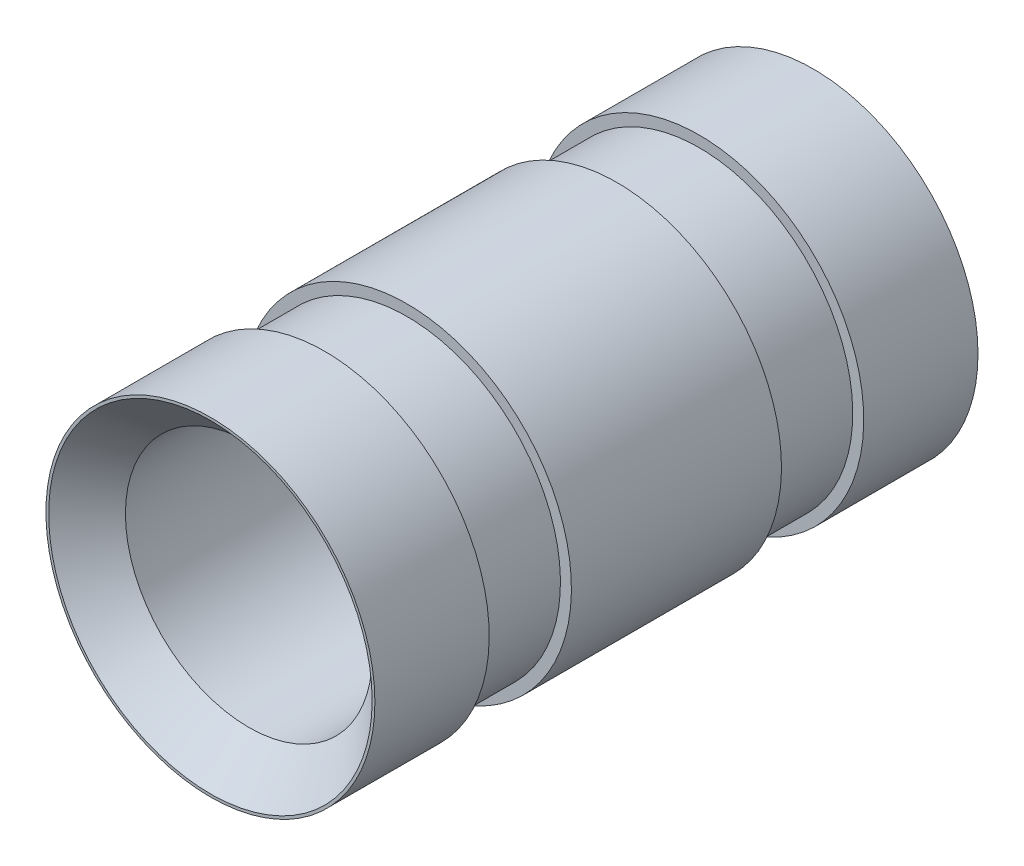
ISO-10303-21;
HEADER;
FILE_DESCRIPTION(('STEP AP214'),'2;1');
FILE_NAME('part.step','',(''),(''),'','','');
FILE_SCHEMA(('AUTOMOTIVE_DESIGN { 1 0 10303 214 1 1 1 1 }'));
ENDSEC;
DATA;
#1=APPLICATION_CONTEXT('core data for automotive mechanical design processes');
#2=APPLICATION_PROTOCOL_DEFINITION('international standard','automotive_design',2000,#1);
#3=PRODUCT_CONTEXT('',#1,'mechanical');
#4=PRODUCT('Part','Part','',(#3));
#5=PRODUCT_RELATED_PRODUCT_CATEGORY('part','',(#4));
#6=PRODUCT_DEFINITION_FORMATION('','',#4);
#7=PRODUCT_DEFINITION_CONTEXT('part definition',#1,'design');
#8=PRODUCT_DEFINITION('design','',#6,#7);
#9=PRODUCT_DEFINITION_SHAPE('','',#8);
#10=(LENGTH_UNIT() NAMED_UNIT(*) SI_UNIT(.MILLI.,.METRE.));
#11=(NAMED_UNIT(*) PLANE_ANGLE_UNIT() SI_UNIT($,.RADIAN.));
#12=(NAMED_UNIT(*) SI_UNIT($,.STERADIAN.) SOLID_ANGLE_UNIT());
#13=UNCERTAINTY_MEASURE_WITH_UNIT(LENGTH_MEASURE(1.E-05),#10,'distance_accuracy_value','');
#14=(GEOMETRIC_REPRESENTATION_CONTEXT(3) GLOBAL_UNCERTAINTY_ASSIGNED_CONTEXT((#13)) GLOBAL_UNIT_ASSIGNED_CONTEXT((#10,
#11,#12)) REPRESENTATION_CONTEXT('',''));
#15=CARTESIAN_POINT('',(0.,0.,0.));
#16=DIRECTION('',(0.,0.,1.));
#17=DIRECTION('',(1.,0.,0.));
#18=AXIS2_PLACEMENT_3D('',#15,#16,#17);
#19=CARTESIAN_POINT('',(0.,0.,69.85));
#20=DIRECTION('',(0.,0.,-1.));
#21=DIRECTION('',(-1.,0.,0.));
#22=AXIS2_PLACEMENT_3D('',#19,#20,#21);
#23=CYLINDRICAL_SURFACE('',#22,38.1);
#24=CARTESIAN_POINT('',(0.,0.,69.85));
#25=DIRECTION('',(0.,0.,1.));
#26=DIRECTION('',(1.,0.,0.));
#27=AXIS2_PLACEMENT_3D('',#24,#25,#26);
#28=CIRCLE('',#27,38.1);
#29=CARTESIAN_POINT('',(38.1,0.,69.85));
#30=VERTEX_POINT('',#29);
#31=EDGE_CURVE('E57',#30,#30,#28,.T.);
#32=ORIENTED_EDGE('',*,*,#31,.F.);
#33=EDGE_LOOP('',(#32));
#34=FACE_BOUND('',#33,.T.);
#35=CARTESIAN_POINT('',(0.,0.,43.3788561936318));
#36=DIRECTION('',(0.,0.,1.));
#37=DIRECTION('',(0.,-1.,0.));
#38=AXIS2_PLACEMENT_3D('',#35,#36,#37);
#39=CIRCLE('',#38,38.1);
#40=CARTESIAN_POINT('',(0.,-38.1,43.3788561936318));
#41=VERTEX_POINT('',#40);
#42=EDGE_CURVE('E72',#41,#41,#39,.T.);
#43=ORIENTED_EDGE('',*,*,#42,.T.);
#44=EDGE_LOOP('',(#43));
#45=FACE_BOUND('',#44,.T.);
#46=ADVANCED_FACE('F43',(#34,#45),#23,.T.);
#47=CARTESIAN_POINT('',(0.,0.,-69.85));
#48=DIRECTION('',(0.,0.,1.));
#49=DIRECTION('',(1.,0.,0.));
#50=AXIS2_PLACEMENT_3D('',#47,#48,#49);
#51=CIRCLE('',#50,38.1);
#52=CARTESIAN_POINT('',(38.1,0.,-69.85));
#53=VERTEX_POINT('',#52);
#54=EDGE_CURVE('E62',#53,#53,#51,.T.);
#55=ORIENTED_EDGE('',*,*,#54,.T.);
#56=EDGE_LOOP('',(#55));
#57=FACE_BOUND('',#56,.T.);
#58=CARTESIAN_POINT('',(0.,0.,-43.3788561936318));
#59=DIRECTION('',(0.,0.,1.));
#60=DIRECTION('',(0.,-1.,0.));
#61=AXIS2_PLACEMENT_3D('',#58,#59,#60);
#62=CIRCLE('',#61,38.1);
#63=CARTESIAN_POINT('',(0.,-38.1,-43.3788561936318));
#64=VERTEX_POINT('',#63);
#65=EDGE_CURVE('E86',#64,#64,#62,.T.);
#66=ORIENTED_EDGE('',*,*,#65,.F.);
#67=EDGE_LOOP('',(#66));
#68=FACE_BOUND('',#67,.T.);
#69=ADVANCED_FACE('F113',(#57,#68),#23,.T.);
#70=CARTESIAN_POINT('',(0.,0.,69.85));
#71=DIRECTION('',(0.,0.,1.));
#72=DIRECTION('',(1.,0.,0.));
#73=AXIS2_PLACEMENT_3D('',#70,#71,#72);
#74=PLANE('',#73);
#75=CARTESIAN_POINT('',(0.,0.,69.85));
#76=DIRECTION('',(0.,0.,1.));
#77=DIRECTION('',(1.,0.,0.));
#78=AXIS2_PLACEMENT_3D('',#75,#76,#77);
#79=CIRCLE('',#78,37.4650000000001);
#80=CARTESIAN_POINT('',(37.4650000000001,0.,69.85));
#81=VERTEX_POINT('',#80);
#82=EDGE_CURVE('E10',#81,#81,#79,.F.);
#83=ORIENTED_EDGE('',*,*,#82,.T.);
#84=EDGE_LOOP('',(#83));
#85=FACE_BOUND('',#84,.T.);
#86=ORIENTED_EDGE('',*,*,#31,.T.);
#87=EDGE_LOOP('',(#86));
#88=FACE_BOUND('',#87,.T.);
#89=ADVANCED_FACE('F126',(#85,#88),#74,.T.);
#90=CARTESIAN_POINT('',(0.,0.,-69.85));
#91=DIRECTION('',(0.,0.,1.));
#92=DIRECTION('',(1.,0.,0.));
#93=AXIS2_PLACEMENT_3D('',#90,#91,#92);
#94=PLANE('',#93);
#95=ORIENTED_EDGE('',*,*,#54,.F.);
#96=EDGE_LOOP('',(#95));
#97=FACE_BOUND('',#96,.T.);
#98=CARTESIAN_POINT('',(0.,0.,-69.85));
#99=DIRECTION('',(0.,0.,1.));
#100=DIRECTION('',(1.,0.,0.));
#101=AXIS2_PLACEMENT_3D('',#98,#99,#100);
#102=CIRCLE('',#101,28.575);
#103=CARTESIAN_POINT('',(28.575,0.,-69.85));
#104=VERTEX_POINT('',#103);
#105=EDGE_CURVE('E67',#104,#104,#102,.T.);
#106=ORIENTED_EDGE('',*,*,#105,.T.);
#107=EDGE_LOOP('',(#106));
#108=FACE_BOUND('',#107,.T.);
#109=ADVANCED_FACE('F138',(#97,#108),#94,.F.);
#110=CARTESIAN_POINT('',(0.,0.,69.85));
#111=DIRECTION('',(0.,0.,-1.));
#112=DIRECTION('',(-1.,0.,0.));
#113=AXIS2_PLACEMENT_3D('',#110,#111,#112);
#114=CYLINDRICAL_SURFACE('',#113,28.575);
#115=CARTESIAN_POINT('',(0.,0.,60.9599999999999));
#116=DIRECTION('',(0.,0.,1.));
#117=DIRECTION('',(1.,0.,0.));
#118=AXIS2_PLACEMENT_3D('',#115,#116,#117);
#119=CIRCLE('',#118,28.575);
#120=CARTESIAN_POINT('',(28.575,0.,60.9599999999999));
#121=VERTEX_POINT('',#120);
#122=EDGE_CURVE('E52',#121,#121,#119,.T.);
#123=ORIENTED_EDGE('',*,*,#122,.T.);
#124=EDGE_LOOP('',(#123));
#125=FACE_BOUND('',#124,.T.);
#126=ORIENTED_EDGE('',*,*,#105,.F.);
#127=EDGE_LOOP('',(#126));
#128=FACE_BOUND('',#127,.T.);
#129=ADVANCED_FACE('F143',(#125,#128),#114,.F.);
#130=CARTESIAN_POINT('',(0.,0.,-24.3288561936318));
#131=DIRECTION('',(0.,0.,-1.));
#132=DIRECTION('',(0.,1.,0.));
#133=AXIS2_PLACEMENT_3D('',#130,#131,#132);
#134=PLANE('',#133);
#135=CARTESIAN_POINT('',(0.,0.,-24.3288561936318));
#136=DIRECTION('',(0.,0.,1.));
#137=DIRECTION('',(0.,-1.,0.));
#138=AXIS2_PLACEMENT_3D('',#135,#136,#137);
#139=CIRCLE('',#138,35.56);
#140=CARTESIAN_POINT('',(0.,-35.56,-24.3288561936318));
#141=VERTEX_POINT('',#140);
#142=EDGE_CURVE('E78',#141,#141,#139,.T.);
#143=ORIENTED_EDGE('',*,*,#142,.T.);
#144=EDGE_LOOP('',(#143));
#145=FACE_BOUND('',#144,.T.);
#146=CARTESIAN_POINT('',(0.,0.,-24.3288561936318));
#147=DIRECTION('',(0.,0.,1.));
#148=DIRECTION('',(0.,-1.,0.));
#149=AXIS2_PLACEMENT_3D('',#146,#147,#148);
#150=CIRCLE('',#149,38.1);
#151=CARTESIAN_POINT('',(0.,-38.1,-24.3288561936318));
#152=VERTEX_POINT('',#151);
#153=EDGE_CURVE('E73',#152,#152,#150,.T.);
#154=ORIENTED_EDGE('',*,*,#153,.F.);
#155=EDGE_LOOP('',(#154));
#156=FACE_BOUND('',#155,.T.);
#157=ADVANCED_FACE('F148',(#145,#156),#134,.T.);
#158=CARTESIAN_POINT('',(0.,0.,69.85));
#159=DIRECTION('',(0.,0.,1.));
#160=DIRECTION('',(0.,-1.,0.));
#161=AXIS2_PLACEMENT_3D('',#158,#159,#160);
#162=CYLINDRICAL_SURFACE('',#161,35.56);
#163=CARTESIAN_POINT('',(0.,0.,-43.3788561936318));
#164=DIRECTION('',(0.,0.,1.));
#165=DIRECTION('',(0.,-1.,0.));
#166=AXIS2_PLACEMENT_3D('',#163,#164,#165);
#167=CIRCLE('',#166,35.56);
#168=CARTESIAN_POINT('',(0.,-35.56,-43.3788561936318));
#169=VERTEX_POINT('',#168);
#170=EDGE_CURVE('E82',#169,#169,#167,.T.);
#171=ORIENTED_EDGE('',*,*,#170,.T.);
#172=EDGE_LOOP('',(#171));
#173=FACE_BOUND('',#172,.T.);
#174=ORIENTED_EDGE('',*,*,#142,.F.);
#175=EDGE_LOOP('',(#174));
#176=FACE_BOUND('',#175,.T.);
#177=ADVANCED_FACE('F121',(#173,#176),#162,.T.);
#178=CARTESIAN_POINT('',(0.,0.,-43.3788561936318));
#179=DIRECTION('',(0.,0.,1.));
#180=DIRECTION('',(0.,-1.,0.));
#181=AXIS2_PLACEMENT_3D('',#178,#179,#180);
#182=PLANE('',#181);
#183=ORIENTED_EDGE('',*,*,#65,.T.);
#184=EDGE_LOOP('',(#183));
#185=FACE_BOUND('',#184,.T.);
#186=ORIENTED_EDGE('',*,*,#170,.F.);
#187=EDGE_LOOP('',(#186));
#188=FACE_BOUND('',#187,.T.);
#189=ADVANCED_FACE('F111',(#185,#188),#182,.T.);
#190=ORIENTED_EDGE('',*,*,#153,.T.);
#191=EDGE_LOOP('',(#190));
#192=FACE_BOUND('',#191,.T.);
#193=CARTESIAN_POINT('',(0.,0.,24.3288561936318));
#194=DIRECTION('',(0.,0.,1.));
#195=DIRECTION('',(0.,-1.,0.));
#196=AXIS2_PLACEMENT_3D('',#193,#194,#195);
#197=CIRCLE('',#196,38.1);
#198=CARTESIAN_POINT('',(0.,-38.1,24.3288561936318));
#199=VERTEX_POINT('',#198);
#200=EDGE_CURVE('E77',#199,#199,#197,.T.);
#201=ORIENTED_EDGE('',*,*,#200,.F.);
#202=EDGE_LOOP('',(#201));
#203=FACE_BOUND('',#202,.T.);
#204=ADVANCED_FACE('F108',(#192,#203),#23,.T.);
#205=CARTESIAN_POINT('',(0.,0.,43.3788561936318));
#206=DIRECTION('',(0.,0.,-1.));
#207=DIRECTION('',(0.,1.,0.));
#208=AXIS2_PLACEMENT_3D('',#205,#206,#207);
#209=PLANE('',#208);
#210=CARTESIAN_POINT('',(0.,0.,43.3788561936318));
#211=DIRECTION('',(0.,0.,1.));
#212=DIRECTION('',(0.,-1.,0.));
#213=AXIS2_PLACEMENT_3D('',#210,#211,#212);
#214=CIRCLE('',#213,35.56);
#215=CARTESIAN_POINT('',(0.,-35.56,43.3788561936318));
#216=VERTEX_POINT('',#215);
#217=EDGE_CURVE('E93',#216,#216,#214,.T.);
#218=ORIENTED_EDGE('',*,*,#217,.T.);
#219=EDGE_LOOP('',(#218));
#220=FACE_BOUND('',#219,.T.);
#221=ORIENTED_EDGE('',*,*,#42,.F.);
#222=EDGE_LOOP('',(#221));
#223=FACE_BOUND('',#222,.T.);
#224=ADVANCED_FACE('F110',(#220,#223),#209,.T.);
#225=CARTESIAN_POINT('',(0.,0.,69.85));
#226=DIRECTION('',(0.,0.,1.));
#227=DIRECTION('',(0.,-1.,0.));
#228=AXIS2_PLACEMENT_3D('',#225,#226,#227);
#229=CYLINDRICAL_SURFACE('',#228,35.56);
#230=CARTESIAN_POINT('',(0.,0.,24.3288561936318));
#231=DIRECTION('',(0.,0.,1.));
#232=DIRECTION('',(0.,-1.,0.));
#233=AXIS2_PLACEMENT_3D('',#230,#231,#232);
#234=CIRCLE('',#233,35.56);
#235=CARTESIAN_POINT('',(0.,-35.56,24.3288561936318));
#236=VERTEX_POINT('',#235);
#237=EDGE_CURVE('E97',#236,#236,#234,.T.);
#238=ORIENTED_EDGE('',*,*,#237,.T.);
#239=EDGE_LOOP('',(#238));
#240=FACE_BOUND('',#239,.T.);
#241=ORIENTED_EDGE('',*,*,#217,.F.);
#242=EDGE_LOOP('',(#241));
#243=FACE_BOUND('',#242,.T.);
#244=ADVANCED_FACE('F118',(#240,#243),#229,.T.);
#245=CARTESIAN_POINT('',(0.,0.,24.3288561936318));
#246=DIRECTION('',(0.,0.,1.));
#247=DIRECTION('',(0.,-1.,0.));
#248=AXIS2_PLACEMENT_3D('',#245,#246,#247);
#249=PLANE('',#248);
#250=ORIENTED_EDGE('',*,*,#200,.T.);
#251=EDGE_LOOP('',(#250));
#252=FACE_BOUND('',#251,.T.);
#253=ORIENTED_EDGE('',*,*,#237,.F.);
#254=EDGE_LOOP('',(#253));
#255=FACE_BOUND('',#254,.T.);
#256=ADVANCED_FACE('F105',(#252,#255),#249,.T.);
#257=CARTESIAN_POINT('',(0.,0.,60.9599999999999));
#258=DIRECTION('',(0.,0.,1.));
#259=DIRECTION('',(1.,0.,0.));
#260=AXIS2_PLACEMENT_3D('',#257,#258,#259);
#261=CONICAL_SURFACE('',#260,28.575,0.785398163397448);
#262=ORIENTED_EDGE('',*,*,#82,.F.);
#263=EDGE_LOOP('',(#262));
#264=FACE_BOUND('',#263,.T.);
#265=ORIENTED_EDGE('',*,*,#122,.F.);
#266=EDGE_LOOP('',(#265));
#267=FACE_BOUND('',#266,.T.);
#268=ADVANCED_FACE('F46',(#264,#267),#261,.F.);
#269=CLOSED_SHELL('',(#46,#69,#89,#109,#129,#157,#177,#189,#204,#224,#244,#256,#268));
#270=MANIFOLD_SOLID_BREP('B2',#269);
#271=ADVANCED_BREP_SHAPE_REPRESENTATION('',(#18,#270),#14);
#272=SHAPE_DEFINITION_REPRESENTATION(#9,#271);
ENDSEC;
END-ISO-10303-21;
